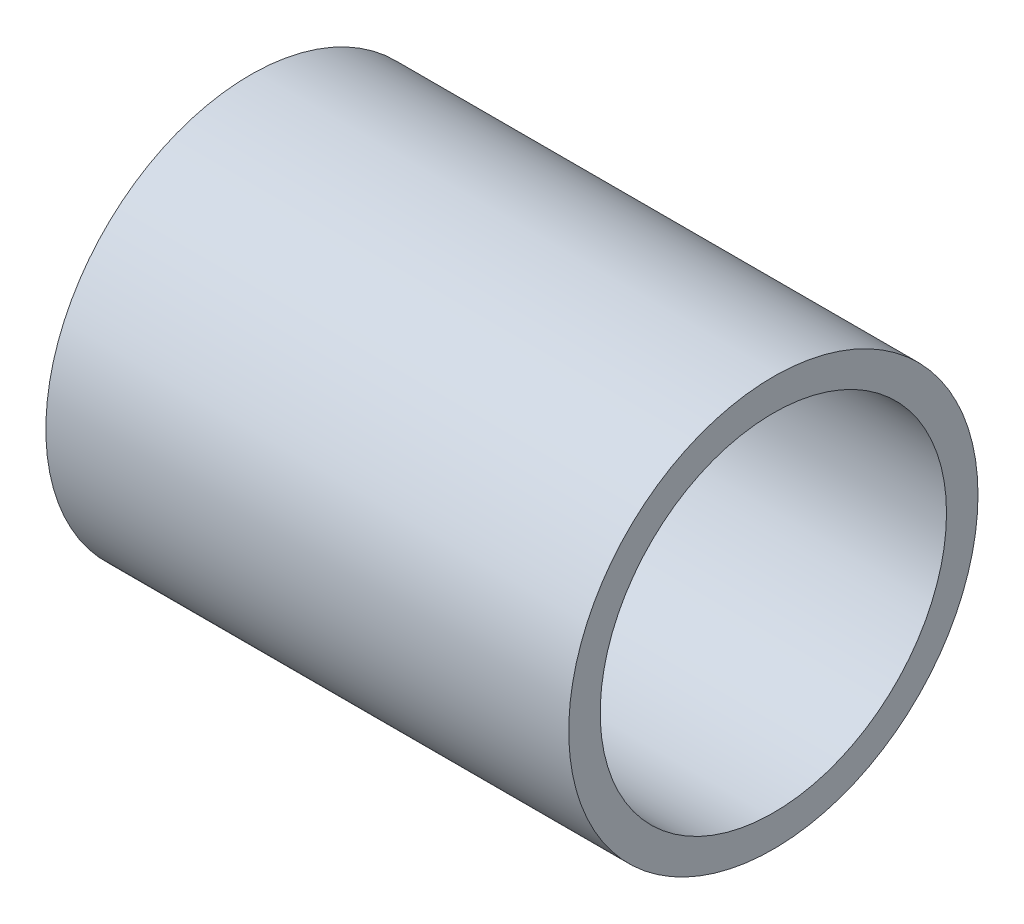
ISO-10303-21;
HEADER;
FILE_DESCRIPTION(('STEP AP214'),'2;1');
FILE_NAME('part.step','',(''),(''),'','','');
FILE_SCHEMA(('AUTOMOTIVE_DESIGN { 1 0 10303 214 1 1 1 1 }'));
ENDSEC;
DATA;
#1=APPLICATION_CONTEXT('core data for automotive mechanical design processes');
#2=APPLICATION_PROTOCOL_DEFINITION('international standard','automotive_design',2000,#1);
#3=PRODUCT_CONTEXT('',#1,'mechanical');
#4=PRODUCT('Part','Part','',(#3));
#5=PRODUCT_RELATED_PRODUCT_CATEGORY('part','',(#4));
#6=PRODUCT_DEFINITION_FORMATION('','',#4);
#7=PRODUCT_DEFINITION_CONTEXT('part definition',#1,'design');
#8=PRODUCT_DEFINITION('design','',#6,#7);
#9=PRODUCT_DEFINITION_SHAPE('','',#8);
#10=(LENGTH_UNIT() NAMED_UNIT(*) SI_UNIT(.MILLI.,.METRE.));
#11=(NAMED_UNIT(*) PLANE_ANGLE_UNIT() SI_UNIT($,.RADIAN.));
#12=(NAMED_UNIT(*) SI_UNIT($,.STERADIAN.) SOLID_ANGLE_UNIT());
#13=UNCERTAINTY_MEASURE_WITH_UNIT(LENGTH_MEASURE(1.E-05),#10,'distance_accuracy_value','');
#14=(GEOMETRIC_REPRESENTATION_CONTEXT(3) GLOBAL_UNCERTAINTY_ASSIGNED_CONTEXT((#13)) GLOBAL_UNIT_ASSIGNED_CONTEXT((#10,
#11,#12)) REPRESENTATION_CONTEXT('',''));
#15=CARTESIAN_POINT('',(0.,0.,0.));
#16=DIRECTION('',(0.,0.,1.));
#17=DIRECTION('',(1.,0.,0.));
#18=AXIS2_PLACEMENT_3D('',#15,#16,#17);
#19=CARTESIAN_POINT('',(83.04,0.,0.));
#20=DIRECTION('',(1.,0.,0.));
#21=DIRECTION('',(0.,0.,-1.));
#22=AXIS2_PLACEMENT_3D('',#19,#20,#21);
#23=PLANE('',#22);
#24=CARTESIAN_POINT('',(83.04,0.,0.));
#25=DIRECTION('',(1.,0.,0.));
#26=DIRECTION('',(0.,0.,-1.));
#27=AXIS2_PLACEMENT_3D('',#24,#25,#26);
#28=CIRCLE('',#27,32.5);
#29=CARTESIAN_POINT('',(83.04,0.,-32.5));
#30=VERTEX_POINT('',#29);
#31=EDGE_CURVE('E10',#30,#30,#28,.T.);
#32=ORIENTED_EDGE('',*,*,#31,.T.);
#33=EDGE_LOOP('',(#32));
#34=FACE_BOUND('',#33,.T.);
#35=CARTESIAN_POINT('',(83.04,0.,0.));
#36=DIRECTION('',(1.,0.,0.));
#37=DIRECTION('',(0.,0.,-1.));
#38=AXIS2_PLACEMENT_3D('',#35,#36,#37);
#39=CIRCLE('',#38,27.5);
#40=CARTESIAN_POINT('',(83.04,0.,-27.5));
#41=VERTEX_POINT('',#40);
#42=EDGE_CURVE('E49',#41,#41,#39,.T.);
#43=ORIENTED_EDGE('',*,*,#42,.F.);
#44=EDGE_LOOP('',(#43));
#45=FACE_BOUND('',#44,.T.);
#46=ADVANCED_FACE('F38',(#34,#45),#23,.T.);
#47=CARTESIAN_POINT('',(0.,0.,0.));
#48=DIRECTION('',(1.,0.,0.));
#49=DIRECTION('',(0.,0.,-1.));
#50=AXIS2_PLACEMENT_3D('',#47,#48,#49);
#51=PLANE('',#50);
#52=CARTESIAN_POINT('',(0.,0.,0.));
#53=DIRECTION('',(1.,0.,0.));
#54=DIRECTION('',(0.,0.,-1.));
#55=AXIS2_PLACEMENT_3D('',#52,#53,#54);
#56=CIRCLE('',#55,32.5);
#57=CARTESIAN_POINT('',(0.,0.,-32.5));
#58=VERTEX_POINT('',#57);
#59=EDGE_CURVE('E42',#58,#58,#56,.T.);
#60=ORIENTED_EDGE('',*,*,#59,.F.);
#61=EDGE_LOOP('',(#60));
#62=FACE_BOUND('',#61,.T.);
#63=CARTESIAN_POINT('',(0.,0.,0.));
#64=DIRECTION('',(1.,0.,0.));
#65=DIRECTION('',(0.,0.,-1.));
#66=AXIS2_PLACEMENT_3D('',#63,#64,#65);
#67=CIRCLE('',#66,27.5);
#68=CARTESIAN_POINT('',(0.,0.,-27.5));
#69=VERTEX_POINT('',#68);
#70=EDGE_CURVE('E51',#69,#69,#67,.T.);
#71=ORIENTED_EDGE('',*,*,#70,.T.);
#72=EDGE_LOOP('',(#71));
#73=FACE_BOUND('',#72,.T.);
#74=ADVANCED_FACE('F61',(#62,#73),#51,.F.);
#75=CARTESIAN_POINT('',(83.04,0.,0.));
#76=DIRECTION('',(-1.,0.,0.));
#77=DIRECTION('',(0.,0.,1.));
#78=AXIS2_PLACEMENT_3D('',#75,#76,#77);
#79=CYLINDRICAL_SURFACE('',#78,32.5);
#80=ORIENTED_EDGE('',*,*,#31,.F.);
#81=EDGE_LOOP('',(#80));
#82=FACE_BOUND('',#81,.T.);
#83=ORIENTED_EDGE('',*,*,#59,.T.);
#84=EDGE_LOOP('',(#83));
#85=FACE_BOUND('',#84,.T.);
#86=ADVANCED_FACE('F40',(#82,#85),#79,.T.);
#87=CARTESIAN_POINT('',(83.04,0.,0.));
#88=DIRECTION('',(-1.,0.,0.));
#89=DIRECTION('',(0.,0.,1.));
#90=AXIS2_PLACEMENT_3D('',#87,#88,#89);
#91=CYLINDRICAL_SURFACE('',#90,27.5);
#92=ORIENTED_EDGE('',*,*,#42,.T.);
#93=EDGE_LOOP('',(#92));
#94=FACE_BOUND('',#93,.T.);
#95=ORIENTED_EDGE('',*,*,#70,.F.);
#96=EDGE_LOOP('',(#95));
#97=FACE_BOUND('',#96,.T.);
#98=ADVANCED_FACE('F57',(#94,#97),#91,.F.);
#99=CLOSED_SHELL('',(#46,#74,#86,#98));
#100=MANIFOLD_SOLID_BREP('B2',#99);
#101=ADVANCED_BREP_SHAPE_REPRESENTATION('',(#18,#100),#14);
#102=SHAPE_DEFINITION_REPRESENTATION(#9,#101);
ENDSEC;
END-ISO-10303-21;
